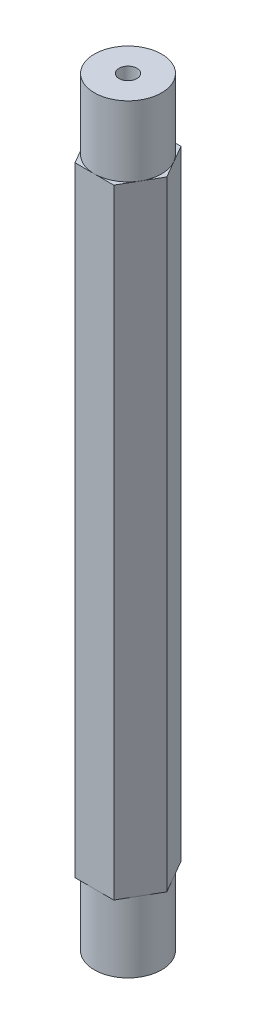
ISO-10303-21;
HEADER;
FILE_DESCRIPTION(('STEP AP214'),'2;1');
FILE_NAME('part.step','',(''),(''),'','','');
FILE_SCHEMA(('AUTOMOTIVE_DESIGN { 1 0 10303 214 1 1 1 1 }'));
ENDSEC;
DATA;
#1=APPLICATION_CONTEXT('core data for automotive mechanical design processes');
#2=APPLICATION_PROTOCOL_DEFINITION('international standard','automotive_design',2000,#1);
#3=PRODUCT_CONTEXT('',#1,'mechanical');
#4=PRODUCT('Part','Part','',(#3));
#5=PRODUCT_RELATED_PRODUCT_CATEGORY('part','',(#4));
#6=PRODUCT_DEFINITION_FORMATION('','',#4);
#7=PRODUCT_DEFINITION_CONTEXT('part definition',#1,'design');
#8=PRODUCT_DEFINITION('design','',#6,#7);
#9=PRODUCT_DEFINITION_SHAPE('','',#8);
#10=(LENGTH_UNIT() NAMED_UNIT(*) SI_UNIT(.MILLI.,.METRE.));
#11=(NAMED_UNIT(*) PLANE_ANGLE_UNIT() SI_UNIT($,.RADIAN.));
#12=(NAMED_UNIT(*) SI_UNIT($,.STERADIAN.) SOLID_ANGLE_UNIT());
#13=UNCERTAINTY_MEASURE_WITH_UNIT(LENGTH_MEASURE(1.E-05),#10,'distance_accuracy_value','');
#14=(GEOMETRIC_REPRESENTATION_CONTEXT(3) GLOBAL_UNCERTAINTY_ASSIGNED_CONTEXT((#13)) GLOBAL_UNIT_ASSIGNED_CONTEXT((#10,
#11,#12)) REPRESENTATION_CONTEXT('',''));
#15=CARTESIAN_POINT('',(0.,0.,0.));
#16=DIRECTION('',(0.,0.,1.));
#17=DIRECTION('',(1.,0.,0.));
#18=AXIS2_PLACEMENT_3D('',#15,#16,#17);
#19=CARTESIAN_POINT('',(0.,-21.9456,0.));
#20=DIRECTION('',(0.,1.,0.));
#21=DIRECTION('',(0.,0.,1.));
#22=AXIS2_PLACEMENT_3D('',#19,#20,#21);
#23=PLANE('',#22);
#24=CARTESIAN_POINT('',(0.,-21.9456,0.));
#25=DIRECTION('',(0.,-1.,0.));
#26=DIRECTION('',(0.,0.,-1.));
#27=AXIS2_PLACEMENT_3D('',#24,#25,#26);
#28=CIRCLE('',#27,2.38125);
#29=CARTESIAN_POINT('',(0.,-21.9456,-2.38125));
#30=VERTEX_POINT('',#29);
#31=CARTESIAN_POINT('',(2.06222299276169,-21.9456,-1.190625));
#32=VERTEX_POINT('',#31);
#33=EDGE_CURVE('E51',#30,#32,#28,.T.);
#34=ORIENTED_EDGE('',*,*,#33,.F.);
#35=DIRECTION('',(-1.,0.,0.));
#36=VECTOR('',#35,1.);
#37=CARTESIAN_POINT('',(1.37481532850779,-21.9456,-2.38125));
#38=LINE('',#37,#36);
#39=CARTESIAN_POINT('',(1.37481532850779,-21.9456,-2.38125));
#40=VERTEX_POINT('',#39);
#41=EDGE_CURVE('E132',#40,#30,#38,.T.);
#42=ORIENTED_EDGE('',*,*,#41,.F.);
#43=DIRECTION('',(-0.5,0.,-0.866025403784439));
#44=VECTOR('',#43,1.);
#45=CARTESIAN_POINT('',(2.74963065701559,-21.9456,0.));
#46=LINE('',#45,#44);
#47=EDGE_CURVE('E157',#32,#40,#46,.T.);
#48=ORIENTED_EDGE('',*,*,#47,.F.);
#49=EDGE_LOOP('',(#34,#42,#48));
#50=FACE_BOUND('',#49,.T.);
#51=ADVANCED_FACE('F39',(#50),#23,.F.);
#52=CARTESIAN_POINT('',(2.06222299276169,-21.9456,1.190625));
#53=VERTEX_POINT('',#52);
#54=EDGE_CURVE('E11',#32,#53,#28,.T.);
#55=ORIENTED_EDGE('',*,*,#54,.F.);
#56=CARTESIAN_POINT('',(2.74963065701559,-21.9456,0.));
#57=VERTEX_POINT('',#56);
#58=EDGE_CURVE('E155',#57,#32,#46,.T.);
#59=ORIENTED_EDGE('',*,*,#58,.F.);
#60=DIRECTION('',(0.5,0.,-0.866025403784439));
#61=VECTOR('',#60,1.);
#62=CARTESIAN_POINT('',(1.3748153285078,-21.9456,2.38125));
#63=LINE('',#62,#61);
#64=EDGE_CURVE('E225',#53,#57,#63,.T.);
#65=ORIENTED_EDGE('',*,*,#64,.F.);
#66=EDGE_LOOP('',(#55,#59,#65));
#67=FACE_BOUND('',#66,.T.);
#68=ADVANCED_FACE('F308',(#67),#23,.F.);
#69=CARTESIAN_POINT('',(0.,-21.9456,2.38125));
#70=VERTEX_POINT('',#69);
#71=EDGE_CURVE('E49',#53,#70,#28,.T.);
#72=ORIENTED_EDGE('',*,*,#71,.F.);
#73=CARTESIAN_POINT('',(1.3748153285078,-21.9456,2.38125));
#74=VERTEX_POINT('',#73);
#75=EDGE_CURVE('E226',#74,#53,#63,.T.);
#76=ORIENTED_EDGE('',*,*,#75,.F.);
#77=DIRECTION('',(1.,0.,0.));
#78=VECTOR('',#77,1.);
#79=CARTESIAN_POINT('',(-1.3748153285078,-21.9456,2.38125));
#80=LINE('',#79,#78);
#81=EDGE_CURVE('E186',#70,#74,#80,.T.);
#82=ORIENTED_EDGE('',*,*,#81,.F.);
#83=EDGE_LOOP('',(#72,#76,#82));
#84=FACE_BOUND('',#83,.T.);
#85=ADVANCED_FACE('F313',(#84),#23,.F.);
#86=CARTESIAN_POINT('',(-2.0622229927617,-21.9456,1.190625));
#87=VERTEX_POINT('',#86);
#88=EDGE_CURVE('E171',#70,#87,#28,.T.);
#89=ORIENTED_EDGE('',*,*,#88,.F.);
#90=CARTESIAN_POINT('',(-1.3748153285078,-21.9456,2.38125));
#91=VERTEX_POINT('',#90);
#92=EDGE_CURVE('E221',#91,#70,#80,.T.);
#93=ORIENTED_EDGE('',*,*,#92,.F.);
#94=DIRECTION('',(0.5,0.,0.866025403784439));
#95=VECTOR('',#94,1.);
#96=CARTESIAN_POINT('',(-2.74963065701559,-21.9456,0.));
#97=LINE('',#96,#95);
#98=EDGE_CURVE('E234',#87,#91,#97,.T.);
#99=ORIENTED_EDGE('',*,*,#98,.F.);
#100=EDGE_LOOP('',(#89,#93,#99));
#101=FACE_BOUND('',#100,.T.);
#102=ADVANCED_FACE('F328',(#101),#23,.F.);
#103=CARTESIAN_POINT('',(-2.06222299276169,-21.9456,-1.190625));
#104=VERTEX_POINT('',#103);
#105=EDGE_CURVE('E166',#87,#104,#28,.T.);
#106=ORIENTED_EDGE('',*,*,#105,.F.);
#107=CARTESIAN_POINT('',(-2.74963065701559,-21.9456,0.));
#108=VERTEX_POINT('',#107);
#109=EDGE_CURVE('E235',#108,#87,#97,.T.);
#110=ORIENTED_EDGE('',*,*,#109,.F.);
#111=DIRECTION('',(-0.5,0.,0.866025403784439));
#112=VECTOR('',#111,1.);
#113=CARTESIAN_POINT('',(-1.3748153285078,-21.9456,-2.38125));
#114=LINE('',#113,#112);
#115=EDGE_CURVE('E144',#104,#108,#114,.T.);
#116=ORIENTED_EDGE('',*,*,#115,.F.);
#117=EDGE_LOOP('',(#106,#110,#116));
#118=FACE_BOUND('',#117,.T.);
#119=ADVANCED_FACE('F318',(#118),#23,.F.);
#120=CARTESIAN_POINT('',(0.,21.9456,0.));
#121=DIRECTION('',(0.,1.,0.));
#122=DIRECTION('',(0.,0.,1.));
#123=AXIS2_PLACEMENT_3D('',#120,#121,#122);
#124=PLANE('',#123);
#125=CARTESIAN_POINT('',(0.,21.9456,0.));
#126=DIRECTION('',(0.,1.,0.));
#127=DIRECTION('',(0.,0.,1.));
#128=AXIS2_PLACEMENT_3D('',#125,#126,#127);
#129=CIRCLE('',#128,2.38125);
#130=CARTESIAN_POINT('',(0.,21.9456,2.38125));
#131=VERTEX_POINT('',#130);
#132=CARTESIAN_POINT('',(2.06222299276169,21.9456,1.190625));
#133=VERTEX_POINT('',#132);
#134=EDGE_CURVE('E175',#131,#133,#129,.T.);
#135=ORIENTED_EDGE('',*,*,#134,.F.);
#136=DIRECTION('',(1.,0.,0.));
#137=VECTOR('',#136,1.);
#138=CARTESIAN_POINT('',(-1.3748153285078,21.9456,2.38125));
#139=LINE('',#138,#137);
#140=CARTESIAN_POINT('',(1.3748153285078,21.9456,2.38125));
#141=VERTEX_POINT('',#140);
#142=EDGE_CURVE('E195',#131,#141,#139,.T.);
#143=ORIENTED_EDGE('',*,*,#142,.T.);
#144=DIRECTION('',(0.5,0.,-0.866025403784439));
#145=VECTOR('',#144,1.);
#146=CARTESIAN_POINT('',(1.3748153285078,21.9456,2.38125));
#147=LINE('',#146,#145);
#148=EDGE_CURVE('E196',#141,#133,#147,.T.);
#149=ORIENTED_EDGE('',*,*,#148,.T.);
#150=EDGE_LOOP('',(#135,#143,#149));
#151=FACE_BOUND('',#150,.T.);
#152=ADVANCED_FACE('F326',(#151),#124,.T.);
#153=CARTESIAN_POINT('',(2.06222299276169,21.9456,-1.190625));
#154=VERTEX_POINT('',#153);
#155=EDGE_CURVE('E168',#133,#154,#129,.T.);
#156=ORIENTED_EDGE('',*,*,#155,.F.);
#157=CARTESIAN_POINT('',(2.74963065701559,21.9456,0.));
#158=VERTEX_POINT('',#157);
#159=EDGE_CURVE('E194',#133,#158,#147,.T.);
#160=ORIENTED_EDGE('',*,*,#159,.T.);
#161=DIRECTION('',(-0.5,0.,-0.866025403784439));
#162=VECTOR('',#161,1.);
#163=CARTESIAN_POINT('',(2.74963065701559,21.9456,0.));
#164=LINE('',#163,#162);
#165=EDGE_CURVE('E201',#158,#154,#164,.T.);
#166=ORIENTED_EDGE('',*,*,#165,.T.);
#167=EDGE_LOOP('',(#156,#160,#166));
#168=FACE_BOUND('',#167,.T.);
#169=ADVANCED_FACE('F279',(#168),#124,.T.);
#170=CARTESIAN_POINT('',(0.,21.9456,-2.38125));
#171=VERTEX_POINT('',#170);
#172=EDGE_CURVE('E173',#154,#171,#129,.T.);
#173=ORIENTED_EDGE('',*,*,#172,.F.);
#174=CARTESIAN_POINT('',(1.37481532850779,21.9456,-2.38125));
#175=VERTEX_POINT('',#174);
#176=EDGE_CURVE('E200',#154,#175,#164,.T.);
#177=ORIENTED_EDGE('',*,*,#176,.T.);
#178=DIRECTION('',(-1.,0.,0.));
#179=VECTOR('',#178,1.);
#180=CARTESIAN_POINT('',(1.37481532850779,21.9456,-2.38125));
#181=LINE('',#180,#179);
#182=EDGE_CURVE('E206',#175,#171,#181,.T.);
#183=ORIENTED_EDGE('',*,*,#182,.T.);
#184=EDGE_LOOP('',(#173,#177,#183));
#185=FACE_BOUND('',#184,.T.);
#186=ADVANCED_FACE('F275',(#185),#124,.T.);
#187=CARTESIAN_POINT('',(-2.06222299276169,21.9456,-1.190625));
#188=VERTEX_POINT('',#187);
#189=EDGE_CURVE('E267',#171,#188,#129,.T.);
#190=ORIENTED_EDGE('',*,*,#189,.F.);
#191=CARTESIAN_POINT('',(-1.3748153285078,21.9456,-2.38125));
#192=VERTEX_POINT('',#191);
#193=EDGE_CURVE('E205',#171,#192,#181,.T.);
#194=ORIENTED_EDGE('',*,*,#193,.T.);
#195=DIRECTION('',(-0.5,0.,0.866025403784439));
#196=VECTOR('',#195,1.);
#197=CARTESIAN_POINT('',(-1.3748153285078,21.9456,-2.38125));
#198=LINE('',#197,#196);
#199=EDGE_CURVE('E211',#192,#188,#198,.T.);
#200=ORIENTED_EDGE('',*,*,#199,.T.);
#201=EDGE_LOOP('',(#190,#194,#200));
#202=FACE_BOUND('',#201,.T.);
#203=ADVANCED_FACE('F495',(#202),#124,.T.);
#204=CARTESIAN_POINT('',(-2.0622229927617,21.9456,1.190625));
#205=VERTEX_POINT('',#204);
#206=EDGE_CURVE('E263',#188,#205,#129,.T.);
#207=ORIENTED_EDGE('',*,*,#206,.F.);
#208=CARTESIAN_POINT('',(-2.74963065701559,21.9456,0.));
#209=VERTEX_POINT('',#208);
#210=EDGE_CURVE('E210',#188,#209,#198,.T.);
#211=ORIENTED_EDGE('',*,*,#210,.T.);
#212=DIRECTION('',(0.5,0.,0.866025403784439));
#213=VECTOR('',#212,1.);
#214=CARTESIAN_POINT('',(-2.74963065701559,21.9456,0.));
#215=LINE('',#214,#213);
#216=EDGE_CURVE('E216',#209,#205,#215,.T.);
#217=ORIENTED_EDGE('',*,*,#216,.T.);
#218=EDGE_LOOP('',(#207,#211,#217));
#219=FACE_BOUND('',#218,.T.);
#220=ADVANCED_FACE('F324',(#219),#124,.T.);
#221=EDGE_CURVE('E190',#205,#131,#129,.T.);
#222=ORIENTED_EDGE('',*,*,#221,.F.);
#223=CARTESIAN_POINT('',(-1.3748153285078,21.9456,2.38125));
#224=VERTEX_POINT('',#223);
#225=EDGE_CURVE('E215',#205,#224,#215,.T.);
#226=ORIENTED_EDGE('',*,*,#225,.T.);
#227=EDGE_CURVE('E191',#224,#131,#139,.T.);
#228=ORIENTED_EDGE('',*,*,#227,.T.);
#229=EDGE_LOOP('',(#222,#226,#228));
#230=FACE_BOUND('',#229,.T.);
#231=ADVANCED_FACE('F317',(#230),#124,.T.);
#232=EDGE_CURVE('E150',#104,#30,#28,.T.);
#233=ORIENTED_EDGE('',*,*,#232,.F.);
#234=CARTESIAN_POINT('',(-1.3748153285078,-21.9456,-2.38125));
#235=VERTEX_POINT('',#234);
#236=EDGE_CURVE('E153',#235,#104,#114,.T.);
#237=ORIENTED_EDGE('',*,*,#236,.F.);
#238=EDGE_CURVE('E136',#30,#235,#38,.T.);
#239=ORIENTED_EDGE('',*,*,#238,.F.);
#240=EDGE_LOOP('',(#233,#237,#239));
#241=FACE_BOUND('',#240,.T.);
#242=ADVANCED_FACE('F148',(#241),#23,.F.);
#243=CARTESIAN_POINT('',(-1.3748153285078,21.9456,2.38125));
#244=DIRECTION('',(0.,0.,-1.));
#245=DIRECTION('',(-1.,0.,0.));
#246=AXIS2_PLACEMENT_3D('',#243,#244,#245);
#247=PLANE('',#246);
#248=ORIENTED_EDGE('',*,*,#92,.T.);
#249=ORIENTED_EDGE('',*,*,#81,.T.);
#250=DIRECTION('',(0.,-1.,0.));
#251=VECTOR('',#250,1.);
#252=CARTESIAN_POINT('',(1.3748153285078,21.9456,2.38125));
#253=LINE('',#252,#251);
#254=EDGE_CURVE('E43',#141,#74,#253,.T.);
#255=ORIENTED_EDGE('',*,*,#254,.F.);
#256=ORIENTED_EDGE('',*,*,#142,.F.);
#257=ORIENTED_EDGE('',*,*,#227,.F.);
#258=DIRECTION('',(0.,-1.,0.));
#259=VECTOR('',#258,1.);
#260=CARTESIAN_POINT('',(-1.3748153285078,21.9456,2.38125));
#261=LINE('',#260,#259);
#262=EDGE_CURVE('E220',#224,#91,#261,.T.);
#263=ORIENTED_EDGE('',*,*,#262,.T.);
#264=EDGE_LOOP('',(#248,#249,#255,#256,#257,#263));
#265=FACE_BOUND('',#264,.T.);
#266=ADVANCED_FACE('F41',(#265),#247,.F.);
#267=CARTESIAN_POINT('',(1.3748153285078,21.9456,2.38125));
#268=DIRECTION('',(-0.866025403784439,0.,-0.5));
#269=DIRECTION('',(-0.5,0.,0.866025403784439));
#270=AXIS2_PLACEMENT_3D('',#267,#268,#269);
#271=PLANE('',#270);
#272=ORIENTED_EDGE('',*,*,#75,.T.);
#273=ORIENTED_EDGE('',*,*,#64,.T.);
#274=DIRECTION('',(0.,-1.,0.));
#275=VECTOR('',#274,1.);
#276=CARTESIAN_POINT('',(2.74963065701559,21.9456,0.));
#277=LINE('',#276,#275);
#278=EDGE_CURVE('E250',#158,#57,#277,.T.);
#279=ORIENTED_EDGE('',*,*,#278,.F.);
#280=ORIENTED_EDGE('',*,*,#159,.F.);
#281=ORIENTED_EDGE('',*,*,#148,.F.);
#282=ORIENTED_EDGE('',*,*,#254,.T.);
#283=EDGE_LOOP('',(#272,#273,#279,#280,#281,#282));
#284=FACE_BOUND('',#283,.T.);
#285=ADVANCED_FACE('F282',(#284),#271,.F.);
#286=CARTESIAN_POINT('',(2.74963065701559,21.9456,0.));
#287=DIRECTION('',(-0.866025403784439,0.,0.5));
#288=DIRECTION('',(0.5,0.,0.866025403784439));
#289=AXIS2_PLACEMENT_3D('',#286,#287,#288);
#290=PLANE('',#289);
#291=ORIENTED_EDGE('',*,*,#58,.T.);
#292=ORIENTED_EDGE('',*,*,#47,.T.);
#293=DIRECTION('',(0.,-1.,0.));
#294=VECTOR('',#293,1.);
#295=CARTESIAN_POINT('',(1.37481532850779,21.9456,-2.38125));
#296=LINE('',#295,#294);
#297=EDGE_CURVE('E140',#175,#40,#296,.T.);
#298=ORIENTED_EDGE('',*,*,#297,.F.);
#299=ORIENTED_EDGE('',*,*,#176,.F.);
#300=ORIENTED_EDGE('',*,*,#165,.F.);
#301=ORIENTED_EDGE('',*,*,#278,.T.);
#302=EDGE_LOOP('',(#291,#292,#298,#299,#300,#301));
#303=FACE_BOUND('',#302,.T.);
#304=ADVANCED_FACE('F276',(#303),#290,.F.);
#305=CARTESIAN_POINT('',(1.37481532850779,21.9456,-2.38125));
#306=DIRECTION('',(0.,0.,1.));
#307=DIRECTION('',(1.,0.,0.));
#308=AXIS2_PLACEMENT_3D('',#305,#306,#307);
#309=PLANE('',#308);
#310=ORIENTED_EDGE('',*,*,#41,.T.);
#311=ORIENTED_EDGE('',*,*,#238,.T.);
#312=DIRECTION('',(0.,-1.,0.));
#313=VECTOR('',#312,1.);
#314=CARTESIAN_POINT('',(-1.3748153285078,21.9456,-2.38125));
#315=LINE('',#314,#313);
#316=EDGE_CURVE('E246',#192,#235,#315,.T.);
#317=ORIENTED_EDGE('',*,*,#316,.F.);
#318=ORIENTED_EDGE('',*,*,#193,.F.);
#319=ORIENTED_EDGE('',*,*,#182,.F.);
#320=ORIENTED_EDGE('',*,*,#297,.T.);
#321=EDGE_LOOP('',(#310,#311,#317,#318,#319,#320));
#322=FACE_BOUND('',#321,.T.);
#323=ADVANCED_FACE('F134',(#322),#309,.F.);
#324=CARTESIAN_POINT('',(-1.3748153285078,21.9456,-2.38125));
#325=DIRECTION('',(0.866025403784439,0.,0.5));
#326=DIRECTION('',(0.5,0.,-0.866025403784439));
#327=AXIS2_PLACEMENT_3D('',#324,#325,#326);
#328=PLANE('',#327);
#329=ORIENTED_EDGE('',*,*,#236,.T.);
#330=ORIENTED_EDGE('',*,*,#115,.T.);
#331=DIRECTION('',(0.,-1.,0.));
#332=VECTOR('',#331,1.);
#333=CARTESIAN_POINT('',(-2.74963065701559,21.9456,0.));
#334=LINE('',#333,#332);
#335=EDGE_CURVE('E242',#209,#108,#334,.T.);
#336=ORIENTED_EDGE('',*,*,#335,.F.);
#337=ORIENTED_EDGE('',*,*,#210,.F.);
#338=ORIENTED_EDGE('',*,*,#199,.F.);
#339=ORIENTED_EDGE('',*,*,#316,.T.);
#340=EDGE_LOOP('',(#329,#330,#336,#337,#338,#339));
#341=FACE_BOUND('',#340,.T.);
#342=ADVANCED_FACE('F350',(#341),#328,.F.);
#343=CARTESIAN_POINT('',(-2.74963065701559,21.9456,0.));
#344=DIRECTION('',(0.866025403784439,0.,-0.5));
#345=DIRECTION('',(-0.5,0.,-0.866025403784439));
#346=AXIS2_PLACEMENT_3D('',#343,#344,#345);
#347=PLANE('',#346);
#348=ORIENTED_EDGE('',*,*,#109,.T.);
#349=ORIENTED_EDGE('',*,*,#98,.T.);
#350=ORIENTED_EDGE('',*,*,#262,.F.);
#351=ORIENTED_EDGE('',*,*,#225,.F.);
#352=ORIENTED_EDGE('',*,*,#216,.F.);
#353=ORIENTED_EDGE('',*,*,#335,.T.);
#354=EDGE_LOOP('',(#348,#349,#350,#351,#352,#353));
#355=FACE_BOUND('',#354,.T.);
#356=ADVANCED_FACE('F342',(#355),#347,.F.);
#357=CARTESIAN_POINT('',(0.,21.9456,0.));
#358=DIRECTION('',(0.,-1.,0.));
#359=DIRECTION('',(0.,0.,-1.));
#360=AXIS2_PLACEMENT_3D('',#357,#358,#359);
#361=CYLINDRICAL_SURFACE('',#360,0.635);
#362=CARTESIAN_POINT('',(0.,26.924,0.));
#363=DIRECTION('',(0.,1.,0.));
#364=DIRECTION('',(0.,0.,1.));
#365=AXIS2_PLACEMENT_3D('',#362,#363,#364);
#366=CIRCLE('',#365,0.635);
#367=CARTESIAN_POINT('',(0.,26.924,0.635));
#368=VERTEX_POINT('',#367);
#369=EDGE_CURVE('E179',#368,#368,#366,.T.);
#370=ORIENTED_EDGE('',*,*,#369,.T.);
#371=EDGE_LOOP('',(#370));
#372=FACE_BOUND('',#371,.T.);
#373=CARTESIAN_POINT('',(0.,-26.924,0.));
#374=DIRECTION('',(0.,-1.,0.));
#375=DIRECTION('',(0.,0.,-1.));
#376=AXIS2_PLACEMENT_3D('',#373,#374,#375);
#377=CIRCLE('',#376,0.635);
#378=CARTESIAN_POINT('',(0.,-26.924,-0.635));
#379=VERTEX_POINT('',#378);
#380=EDGE_CURVE('E162',#379,#379,#377,.T.);
#381=ORIENTED_EDGE('',*,*,#380,.T.);
#382=EDGE_LOOP('',(#381));
#383=FACE_BOUND('',#382,.T.);
#384=ADVANCED_FACE('F292',(#372,#383),#361,.F.);
#385=CARTESIAN_POINT('',(0.,26.924,0.));
#386=DIRECTION('',(0.,1.,0.));
#387=DIRECTION('',(0.,0.,1.));
#388=AXIS2_PLACEMENT_3D('',#385,#386,#387);
#389=PLANE('',#388);
#390=CARTESIAN_POINT('',(0.,26.924,0.));
#391=DIRECTION('',(0.,1.,0.));
#392=DIRECTION('',(0.,0.,1.));
#393=AXIS2_PLACEMENT_3D('',#390,#391,#392);
#394=CIRCLE('',#393,2.38125);
#395=CARTESIAN_POINT('',(0.,26.924,2.38125));
#396=VERTEX_POINT('',#395);
#397=EDGE_CURVE('E183',#396,#396,#394,.T.);
#398=ORIENTED_EDGE('',*,*,#397,.T.);
#399=EDGE_LOOP('',(#398));
#400=FACE_BOUND('',#399,.T.);
#401=ORIENTED_EDGE('',*,*,#369,.F.);
#402=EDGE_LOOP('',(#401));
#403=FACE_BOUND('',#402,.T.);
#404=ADVANCED_FACE('F304',(#400,#403),#389,.T.);
#405=CARTESIAN_POINT('',(0.,26.924,0.));
#406=DIRECTION('',(0.,-1.,0.));
#407=DIRECTION('',(0.,0.,-1.));
#408=AXIS2_PLACEMENT_3D('',#405,#406,#407);
#409=CYLINDRICAL_SURFACE('',#408,2.38125);
#410=ORIENTED_EDGE('',*,*,#397,.F.);
#411=EDGE_LOOP('',(#410));
#412=FACE_BOUND('',#411,.T.);
#413=ORIENTED_EDGE('',*,*,#134,.T.);
#414=ORIENTED_EDGE('',*,*,#155,.T.);
#415=ORIENTED_EDGE('',*,*,#172,.T.);
#416=ORIENTED_EDGE('',*,*,#189,.T.);
#417=ORIENTED_EDGE('',*,*,#206,.T.);
#418=ORIENTED_EDGE('',*,*,#221,.T.);
#419=EDGE_LOOP('',(#413,#414,#415,#416,#417,#418));
#420=FACE_BOUND('',#419,.T.);
#421=ADVANCED_FACE('F272',(#412,#420),#409,.T.);
#422=CARTESIAN_POINT('',(0.,-26.924,0.));
#423=DIRECTION('',(0.,-1.,0.));
#424=DIRECTION('',(0.,0.,-1.));
#425=AXIS2_PLACEMENT_3D('',#422,#423,#424);
#426=PLANE('',#425);
#427=CARTESIAN_POINT('',(0.,-26.924,0.));
#428=DIRECTION('',(0.,-1.,0.));
#429=DIRECTION('',(0.,0.,-1.));
#430=AXIS2_PLACEMENT_3D('',#427,#428,#429);
#431=CIRCLE('',#430,2.38125);
#432=CARTESIAN_POINT('',(0.,-26.924,-2.38125));
#433=VERTEX_POINT('',#432);
#434=EDGE_CURVE('E161',#433,#433,#431,.T.);
#435=ORIENTED_EDGE('',*,*,#434,.T.);
#436=EDGE_LOOP('',(#435));
#437=FACE_BOUND('',#436,.T.);
#438=ORIENTED_EDGE('',*,*,#380,.F.);
#439=EDGE_LOOP('',(#438));
#440=FACE_BOUND('',#439,.T.);
#441=ADVANCED_FACE('F294',(#437,#440),#426,.T.);
#442=CARTESIAN_POINT('',(0.,-26.924,0.));
#443=DIRECTION('',(0.,1.,0.));
#444=DIRECTION('',(0.,0.,1.));
#445=AXIS2_PLACEMENT_3D('',#442,#443,#444);
#446=CYLINDRICAL_SURFACE('',#445,2.38125);
#447=ORIENTED_EDGE('',*,*,#434,.F.);
#448=EDGE_LOOP('',(#447));
#449=FACE_BOUND('',#448,.T.);
#450=ORIENTED_EDGE('',*,*,#33,.T.);
#451=ORIENTED_EDGE('',*,*,#54,.T.);
#452=ORIENTED_EDGE('',*,*,#71,.T.);
#453=ORIENTED_EDGE('',*,*,#88,.T.);
#454=ORIENTED_EDGE('',*,*,#105,.T.);
#455=ORIENTED_EDGE('',*,*,#232,.T.);
#456=EDGE_LOOP('',(#450,#451,#452,#453,#454,#455));
#457=FACE_BOUND('',#456,.T.);
#458=ADVANCED_FACE('F164',(#449,#457),#446,.T.);
#459=CLOSED_SHELL('',(#51,#68,#85,#102,#119,#152,#169,#186,#203,#220,#231,#242,#266,#285,#304,
#323,#342,#356,#384,#404,#421,#441,#458));
#460=MANIFOLD_SOLID_BREP('B2',#459);
#461=ADVANCED_BREP_SHAPE_REPRESENTATION('',(#18,#460),#14);
#462=SHAPE_DEFINITION_REPRESENTATION(#9,#461);
ENDSEC;
END-ISO-10303-21;
